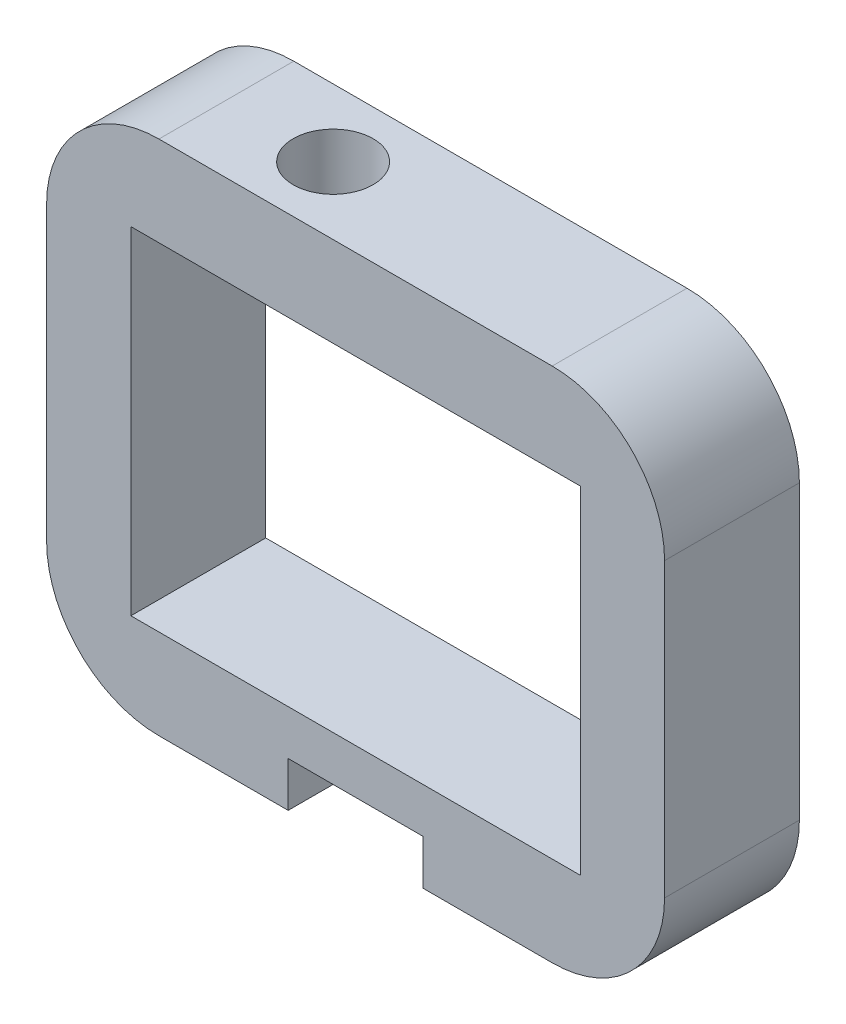
ISO-10303-21;
HEADER;
FILE_DESCRIPTION(('STEP AP214'),'2;1');
FILE_NAME('part.step','',(''),(''),'','','');
FILE_SCHEMA(('AUTOMOTIVE_DESIGN { 1 0 10303 214 1 1 1 1 }'));
ENDSEC;
DATA;
#1=APPLICATION_CONTEXT('core data for automotive mechanical design processes');
#2=APPLICATION_PROTOCOL_DEFINITION('international standard','automotive_design',2000,#1);
#3=PRODUCT_CONTEXT('',#1,'mechanical');
#4=PRODUCT('Part','Part','',(#3));
#5=PRODUCT_RELATED_PRODUCT_CATEGORY('part','',(#4));
#6=PRODUCT_DEFINITION_FORMATION('','',#4);
#7=PRODUCT_DEFINITION_CONTEXT('part definition',#1,'design');
#8=PRODUCT_DEFINITION('design','',#6,#7);
#9=PRODUCT_DEFINITION_SHAPE('','',#8);
#10=(LENGTH_UNIT() NAMED_UNIT(*) SI_UNIT(.MILLI.,.METRE.));
#11=(NAMED_UNIT(*) PLANE_ANGLE_UNIT() SI_UNIT($,.RADIAN.));
#12=(NAMED_UNIT(*) SI_UNIT($,.STERADIAN.) SOLID_ANGLE_UNIT());
#13=UNCERTAINTY_MEASURE_WITH_UNIT(LENGTH_MEASURE(1.E-05),#10,'distance_accuracy_value','');
#14=(GEOMETRIC_REPRESENTATION_CONTEXT(3) GLOBAL_UNCERTAINTY_ASSIGNED_CONTEXT((#13)) GLOBAL_UNIT_ASSIGNED_CONTEXT((#10,
#11,#12)) REPRESENTATION_CONTEXT('',''));
#15=CARTESIAN_POINT('',(0.,0.,0.));
#16=DIRECTION('',(0.,0.,1.));
#17=DIRECTION('',(1.,0.,0.));
#18=AXIS2_PLACEMENT_3D('',#15,#16,#17);
#19=CARTESIAN_POINT('',(-27.5,-23.,6.));
#20=DIRECTION('',(0.,1.,0.));
#21=DIRECTION('',(-1.,0.,0.));
#22=AXIS2_PLACEMENT_3D('',#19,#20,#21);
#23=PLANE('',#22);
#24=DIRECTION('',(1.,0.,0.));
#25=VECTOR('',#24,1.);
#26=CARTESIAN_POINT('',(-27.5,-23.,6.));
#27=LINE('',#26,#25);
#28=CARTESIAN_POINT('',(-17.5,-23.,6.));
#29=VERTEX_POINT('',#28);
#30=CARTESIAN_POINT('',(-6.,-23.,6.));
#31=VERTEX_POINT('',#30);
#32=EDGE_CURVE('E227',#29,#31,#27,.T.);
#33=ORIENTED_EDGE('',*,*,#32,.F.);
#34=DIRECTION('',(0.,0.,-1.));
#35=VECTOR('',#34,1.);
#36=CARTESIAN_POINT('',(-17.5,-23.,6.));
#37=LINE('',#36,#35);
#38=CARTESIAN_POINT('',(-17.5,-23.,-6.));
#39=VERTEX_POINT('',#38);
#40=EDGE_CURVE('E237',#29,#39,#37,.T.);
#41=ORIENTED_EDGE('',*,*,#40,.T.);
#42=DIRECTION('',(1.,0.,0.));
#43=VECTOR('',#42,1.);
#44=CARTESIAN_POINT('',(-27.5,-23.,-6.));
#45=LINE('',#44,#43);
#46=CARTESIAN_POINT('',(-6.,-23.,-6.));
#47=VERTEX_POINT('',#46);
#48=EDGE_CURVE('E238',#39,#47,#45,.T.);
#49=ORIENTED_EDGE('',*,*,#48,.T.);
#50=DIRECTION('',(0.,0.,-1.));
#51=VECTOR('',#50,1.);
#52=CARTESIAN_POINT('',(-6.,-23.,6.));
#53=LINE('',#52,#51);
#54=EDGE_CURVE('E158',#31,#47,#53,.T.);
#55=ORIENTED_EDGE('',*,*,#54,.F.);
#56=EDGE_LOOP('',(#33,#41,#49,#55));
#57=FACE_BOUND('',#56,.T.);
#58=ADVANCED_FACE('F37',(#57),#23,.F.);
#59=CARTESIAN_POINT('',(0.,0.,6.));
#60=DIRECTION('',(0.,0.,-1.));
#61=DIRECTION('',(-1.,0.,0.));
#62=AXIS2_PLACEMENT_3D('',#59,#60,#61);
#63=PLANE('',#62);
#64=DIRECTION('',(0.,-1.,0.));
#65=VECTOR('',#64,1.);
#66=CARTESIAN_POINT('',(-27.5,-23.,6.));
#67=LINE('',#66,#65);
#68=CARTESIAN_POINT('',(-27.5,13.,6.));
#69=VERTEX_POINT('',#68);
#70=CARTESIAN_POINT('',(-27.5,-13.,6.));
#71=VERTEX_POINT('',#70);
#72=EDGE_CURVE('E234',#69,#71,#67,.T.);
#73=ORIENTED_EDGE('',*,*,#72,.T.);
#74=CARTESIAN_POINT('',(-17.5,-13.,6.));
#75=DIRECTION('',(0.,0.,-1.));
#76=DIRECTION('',(-1.,0.,0.));
#77=AXIS2_PLACEMENT_3D('',#74,#75,#76);
#78=CIRCLE('',#77,10.);
#79=EDGE_CURVE('E270',#71,#29,#78,.F.);
#80=ORIENTED_EDGE('',*,*,#79,.T.);
#81=ORIENTED_EDGE('',*,*,#32,.T.);
#82=DIRECTION('',(0.,-1.,0.));
#83=VECTOR('',#82,1.);
#84=CARTESIAN_POINT('',(-6.,-19.,6.));
#85=LINE('',#84,#83);
#86=CARTESIAN_POINT('',(-6.,-19.,6.));
#87=VERTEX_POINT('',#86);
#88=EDGE_CURVE('E185',#87,#31,#85,.T.);
#89=ORIENTED_EDGE('',*,*,#88,.F.);
#90=DIRECTION('',(-1.,0.,0.));
#91=VECTOR('',#90,1.);
#92=CARTESIAN_POINT('',(-6.,-19.,6.));
#93=LINE('',#92,#91);
#94=CARTESIAN_POINT('',(6.,-19.,6.));
#95=VERTEX_POINT('',#94);
#96=EDGE_CURVE('E163',#95,#87,#93,.T.);
#97=ORIENTED_EDGE('',*,*,#96,.F.);
#98=DIRECTION('',(0.,-1.,0.));
#99=VECTOR('',#98,1.);
#100=CARTESIAN_POINT('',(6.,-19.,6.));
#101=LINE('',#100,#99);
#102=CARTESIAN_POINT('',(6.,-23.,6.));
#103=VERTEX_POINT('',#102);
#104=EDGE_CURVE('E188',#95,#103,#101,.T.);
#105=ORIENTED_EDGE('',*,*,#104,.T.);
#106=CARTESIAN_POINT('',(17.5,-23.,6.));
#107=VERTEX_POINT('',#106);
#108=EDGE_CURVE('E230',#103,#107,#27,.T.);
#109=ORIENTED_EDGE('',*,*,#108,.T.);
#110=CARTESIAN_POINT('',(17.5,-13.,6.));
#111=DIRECTION('',(0.,0.,-1.));
#112=DIRECTION('',(-1.,0.,0.));
#113=AXIS2_PLACEMENT_3D('',#110,#111,#112);
#114=CIRCLE('',#113,10.);
#115=CARTESIAN_POINT('',(27.5,-13.,6.));
#116=VERTEX_POINT('',#115);
#117=EDGE_CURVE('E268',#107,#116,#114,.F.);
#118=ORIENTED_EDGE('',*,*,#117,.T.);
#119=DIRECTION('',(0.,1.,0.));
#120=VECTOR('',#119,1.);
#121=CARTESIAN_POINT('',(27.5,23.,6.));
#122=LINE('',#121,#120);
#123=CARTESIAN_POINT('',(27.5,13.,6.));
#124=VERTEX_POINT('',#123);
#125=EDGE_CURVE('E229',#116,#124,#122,.T.);
#126=ORIENTED_EDGE('',*,*,#125,.T.);
#127=CARTESIAN_POINT('',(17.5,13.,6.));
#128=DIRECTION('',(0.,0.,-1.));
#129=DIRECTION('',(-1.,0.,0.));
#130=AXIS2_PLACEMENT_3D('',#127,#128,#129);
#131=CIRCLE('',#130,10.);
#132=CARTESIAN_POINT('',(17.5,23.,6.));
#133=VERTEX_POINT('',#132);
#134=EDGE_CURVE('E58',#124,#133,#131,.F.);
#135=ORIENTED_EDGE('',*,*,#134,.T.);
#136=DIRECTION('',(-1.,0.,0.));
#137=VECTOR('',#136,1.);
#138=CARTESIAN_POINT('',(27.5,23.,6.));
#139=LINE('',#138,#137);
#140=CARTESIAN_POINT('',(-17.5,23.,6.));
#141=VERTEX_POINT('',#140);
#142=EDGE_CURVE('E232',#133,#141,#139,.T.);
#143=ORIENTED_EDGE('',*,*,#142,.T.);
#144=CARTESIAN_POINT('',(-17.5,13.,6.));
#145=DIRECTION('',(0.,0.,-1.));
#146=DIRECTION('',(-1.,0.,0.));
#147=AXIS2_PLACEMENT_3D('',#144,#145,#146);
#148=CIRCLE('',#147,10.);
#149=EDGE_CURVE('E265',#141,#69,#148,.F.);
#150=ORIENTED_EDGE('',*,*,#149,.T.);
#151=EDGE_LOOP('',(#73,#80,#81,#89,#97,#105,#109,#118,#126,#135,#143,#150));
#152=FACE_BOUND('',#151,.T.);
#153=DIRECTION('',(0.,1.,0.));
#154=VECTOR('',#153,1.);
#155=CARTESIAN_POINT('',(20.,-15.,6.));
#156=LINE('',#155,#154);
#157=CARTESIAN_POINT('',(20.,-15.,6.));
#158=VERTEX_POINT('',#157);
#159=CARTESIAN_POINT('',(20.,15.,6.));
#160=VERTEX_POINT('',#159);
#161=EDGE_CURVE('E195',#158,#160,#156,.T.);
#162=ORIENTED_EDGE('',*,*,#161,.F.);
#163=DIRECTION('',(1.,0.,0.));
#164=VECTOR('',#163,1.);
#165=CARTESIAN_POINT('',(-20.,-15.,6.));
#166=LINE('',#165,#164);
#167=CARTESIAN_POINT('',(-20.,-15.,6.));
#168=VERTEX_POINT('',#167);
#169=EDGE_CURVE('E203',#168,#158,#166,.T.);
#170=ORIENTED_EDGE('',*,*,#169,.F.);
#171=DIRECTION('',(0.,-1.,0.));
#172=VECTOR('',#171,1.);
#173=CARTESIAN_POINT('',(-20.,15.,6.));
#174=LINE('',#173,#172);
#175=CARTESIAN_POINT('',(-20.,15.,6.));
#176=VERTEX_POINT('',#175);
#177=EDGE_CURVE('E200',#176,#168,#174,.T.);
#178=ORIENTED_EDGE('',*,*,#177,.F.);
#179=DIRECTION('',(-1.,0.,0.));
#180=VECTOR('',#179,1.);
#181=CARTESIAN_POINT('',(20.,15.,6.));
#182=LINE('',#181,#180);
#183=EDGE_CURVE('E197',#160,#176,#182,.T.);
#184=ORIENTED_EDGE('',*,*,#183,.F.);
#185=EDGE_LOOP('',(#162,#170,#178,#184));
#186=FACE_BOUND('',#185,.T.);
#187=ADVANCED_FACE('F287',(#152,#186),#63,.F.);
#188=CARTESIAN_POINT('',(0.,0.,-6.));
#189=DIRECTION('',(0.,0.,-1.));
#190=DIRECTION('',(-1.,0.,0.));
#191=AXIS2_PLACEMENT_3D('',#188,#189,#190);
#192=PLANE('',#191);
#193=ORIENTED_EDGE('',*,*,#48,.F.);
#194=CARTESIAN_POINT('',(-17.5,-13.,-6.));
#195=DIRECTION('',(0.,0.,-1.));
#196=DIRECTION('',(-1.,0.,0.));
#197=AXIS2_PLACEMENT_3D('',#194,#195,#196);
#198=CIRCLE('',#197,10.);
#199=CARTESIAN_POINT('',(-27.5,-13.,-6.));
#200=VERTEX_POINT('',#199);
#201=EDGE_CURVE('E258',#39,#200,#198,.T.);
#202=ORIENTED_EDGE('',*,*,#201,.T.);
#203=DIRECTION('',(0.,-1.,0.));
#204=VECTOR('',#203,1.);
#205=CARTESIAN_POINT('',(-27.5,-23.,-6.));
#206=LINE('',#205,#204);
#207=CARTESIAN_POINT('',(-27.5,13.,-6.));
#208=VERTEX_POINT('',#207);
#209=EDGE_CURVE('E245',#208,#200,#206,.T.);
#210=ORIENTED_EDGE('',*,*,#209,.F.);
#211=CARTESIAN_POINT('',(-17.5,13.,-6.));
#212=DIRECTION('',(0.,0.,-1.));
#213=DIRECTION('',(-1.,0.,0.));
#214=AXIS2_PLACEMENT_3D('',#211,#212,#213);
#215=CIRCLE('',#214,10.);
#216=CARTESIAN_POINT('',(-17.5,23.,-6.));
#217=VERTEX_POINT('',#216);
#218=EDGE_CURVE('E252',#208,#217,#215,.T.);
#219=ORIENTED_EDGE('',*,*,#218,.T.);
#220=DIRECTION('',(-1.,0.,0.));
#221=VECTOR('',#220,1.);
#222=CARTESIAN_POINT('',(27.5,23.,-6.));
#223=LINE('',#222,#221);
#224=CARTESIAN_POINT('',(17.5,23.,-6.));
#225=VERTEX_POINT('',#224);
#226=EDGE_CURVE('E243',#225,#217,#223,.T.);
#227=ORIENTED_EDGE('',*,*,#226,.F.);
#228=CARTESIAN_POINT('',(17.5,13.,-6.));
#229=DIRECTION('',(0.,0.,-1.));
#230=DIRECTION('',(-1.,0.,0.));
#231=AXIS2_PLACEMENT_3D('',#228,#229,#230);
#232=CIRCLE('',#231,10.);
#233=CARTESIAN_POINT('',(27.5,13.,-6.));
#234=VERTEX_POINT('',#233);
#235=EDGE_CURVE('E254',#225,#234,#232,.T.);
#236=ORIENTED_EDGE('',*,*,#235,.T.);
#237=DIRECTION('',(0.,1.,0.));
#238=VECTOR('',#237,1.);
#239=CARTESIAN_POINT('',(27.5,23.,-6.));
#240=LINE('',#239,#238);
#241=CARTESIAN_POINT('',(27.5,-13.,-6.));
#242=VERTEX_POINT('',#241);
#243=EDGE_CURVE('E240',#242,#234,#240,.T.);
#244=ORIENTED_EDGE('',*,*,#243,.F.);
#245=CARTESIAN_POINT('',(17.5,-13.,-6.));
#246=DIRECTION('',(0.,0.,-1.));
#247=DIRECTION('',(-1.,0.,0.));
#248=AXIS2_PLACEMENT_3D('',#245,#246,#247);
#249=CIRCLE('',#248,10.);
#250=CARTESIAN_POINT('',(17.5,-23.,-6.));
#251=VERTEX_POINT('',#250);
#252=EDGE_CURVE('E256',#242,#251,#249,.T.);
#253=ORIENTED_EDGE('',*,*,#252,.T.);
#254=CARTESIAN_POINT('',(6.,-23.,-6.));
#255=VERTEX_POINT('',#254);
#256=EDGE_CURVE('E226',#255,#251,#45,.T.);
#257=ORIENTED_EDGE('',*,*,#256,.F.);
#258=DIRECTION('',(0.,-1.,0.));
#259=VECTOR('',#258,1.);
#260=CARTESIAN_POINT('',(6.,-19.,-6.));
#261=LINE('',#260,#259);
#262=CARTESIAN_POINT('',(6.,-19.,-6.));
#263=VERTEX_POINT('',#262);
#264=EDGE_CURVE('E162',#263,#255,#261,.T.);
#265=ORIENTED_EDGE('',*,*,#264,.F.);
#266=DIRECTION('',(1.,0.,0.));
#267=VECTOR('',#266,1.);
#268=CARTESIAN_POINT('',(-6.,-19.,-6.));
#269=LINE('',#268,#267);
#270=CARTESIAN_POINT('',(-6.,-19.,-6.));
#271=VERTEX_POINT('',#270);
#272=EDGE_CURVE('E169',#271,#263,#269,.T.);
#273=ORIENTED_EDGE('',*,*,#272,.F.);
#274=DIRECTION('',(0.,-1.,0.));
#275=VECTOR('',#274,1.);
#276=CARTESIAN_POINT('',(-6.,-19.,-6.));
#277=LINE('',#276,#275);
#278=EDGE_CURVE('E151',#271,#47,#277,.T.);
#279=ORIENTED_EDGE('',*,*,#278,.T.);
#280=EDGE_LOOP('',(#193,#202,#210,#219,#227,#236,#244,#253,#257,#265,#273,#279));
#281=FACE_BOUND('',#280,.T.);
#282=DIRECTION('',(1.,0.,0.));
#283=VECTOR('',#282,1.);
#284=CARTESIAN_POINT('',(-20.,-15.,-6.));
#285=LINE('',#284,#283);
#286=CARTESIAN_POINT('',(-20.,-15.,-6.));
#287=VERTEX_POINT('',#286);
#288=CARTESIAN_POINT('',(20.,-15.,-6.));
#289=VERTEX_POINT('',#288);
#290=EDGE_CURVE('E198',#287,#289,#285,.T.);
#291=ORIENTED_EDGE('',*,*,#290,.T.);
#292=DIRECTION('',(0.,1.,0.));
#293=VECTOR('',#292,1.);
#294=CARTESIAN_POINT('',(20.,-15.,-6.));
#295=LINE('',#294,#293);
#296=CARTESIAN_POINT('',(20.,15.,-6.));
#297=VERTEX_POINT('',#296);
#298=EDGE_CURVE('E206',#289,#297,#295,.T.);
#299=ORIENTED_EDGE('',*,*,#298,.T.);
#300=DIRECTION('',(-1.,0.,0.));
#301=VECTOR('',#300,1.);
#302=CARTESIAN_POINT('',(20.,15.,-6.));
#303=LINE('',#302,#301);
#304=CARTESIAN_POINT('',(-20.,15.,-6.));
#305=VERTEX_POINT('',#304);
#306=EDGE_CURVE('E209',#297,#305,#303,.T.);
#307=ORIENTED_EDGE('',*,*,#306,.T.);
#308=DIRECTION('',(0.,-1.,0.));
#309=VECTOR('',#308,1.);
#310=CARTESIAN_POINT('',(-20.,15.,-6.));
#311=LINE('',#310,#309);
#312=EDGE_CURVE('E212',#305,#287,#311,.T.);
#313=ORIENTED_EDGE('',*,*,#312,.T.);
#314=EDGE_LOOP('',(#291,#299,#307,#313));
#315=FACE_BOUND('',#314,.T.);
#316=ADVANCED_FACE('F175',(#281,#315),#192,.T.);
#317=ORIENTED_EDGE('',*,*,#256,.T.);
#318=DIRECTION('',(0.,0.,-1.));
#319=VECTOR('',#318,1.);
#320=CARTESIAN_POINT('',(17.5,-23.,6.));
#321=LINE('',#320,#319);
#322=EDGE_CURVE('E277',#251,#107,#321,.F.);
#323=ORIENTED_EDGE('',*,*,#322,.T.);
#324=ORIENTED_EDGE('',*,*,#108,.F.);
#325=DIRECTION('',(0.,0.,1.));
#326=VECTOR('',#325,1.);
#327=CARTESIAN_POINT('',(6.,-23.,6.));
#328=LINE('',#327,#326);
#329=EDGE_CURVE('E173',#255,#103,#328,.T.);
#330=ORIENTED_EDGE('',*,*,#329,.F.);
#331=EDGE_LOOP('',(#317,#323,#324,#330));
#332=FACE_BOUND('',#331,.T.);
#333=ADVANCED_FACE('F283',(#332),#23,.F.);
#334=CARTESIAN_POINT('',(27.5,23.,6.));
#335=DIRECTION('',(-1.,0.,0.));
#336=DIRECTION('',(0.,-1.,0.));
#337=AXIS2_PLACEMENT_3D('',#334,#335,#336);
#338=PLANE('',#337);
#339=ORIENTED_EDGE('',*,*,#125,.F.);
#340=DIRECTION('',(0.,0.,-1.));
#341=VECTOR('',#340,1.);
#342=CARTESIAN_POINT('',(27.5,-13.,6.));
#343=LINE('',#342,#341);
#344=EDGE_CURVE('E274',#116,#242,#343,.T.);
#345=ORIENTED_EDGE('',*,*,#344,.T.);
#346=ORIENTED_EDGE('',*,*,#243,.T.);
#347=DIRECTION('',(0.,0.,-1.));
#348=VECTOR('',#347,1.);
#349=CARTESIAN_POINT('',(27.5,13.,6.));
#350=LINE('',#349,#348);
#351=EDGE_CURVE('E272',#234,#124,#350,.F.);
#352=ORIENTED_EDGE('',*,*,#351,.T.);
#353=EDGE_LOOP('',(#339,#345,#346,#352));
#354=FACE_BOUND('',#353,.T.);
#355=ADVANCED_FACE('F294',(#354),#338,.F.);
#356=CARTESIAN_POINT('',(27.5,23.,6.));
#357=DIRECTION('',(0.,-1.,0.));
#358=DIRECTION('',(1.,0.,0.));
#359=AXIS2_PLACEMENT_3D('',#356,#357,#358);
#360=PLANE('',#359);
#361=CARTESIAN_POINT('',(-8.,23.,0.));
#362=DIRECTION('',(0.,1.,0.));
#363=DIRECTION('',(0.,0.,1.));
#364=AXIS2_PLACEMENT_3D('',#361,#362,#363);
#365=CIRCLE('',#364,3.556);
#366=CARTESIAN_POINT('',(-8.,23.,3.556));
#367=VERTEX_POINT('',#366);
#368=EDGE_CURVE('E187',#367,#367,#365,.T.);
#369=ORIENTED_EDGE('',*,*,#368,.F.);
#370=EDGE_LOOP('',(#369));
#371=FACE_BOUND('',#370,.T.);
#372=ORIENTED_EDGE('',*,*,#142,.F.);
#373=DIRECTION('',(0.,0.,-1.));
#374=VECTOR('',#373,1.);
#375=CARTESIAN_POINT('',(17.5,23.,6.));
#376=LINE('',#375,#374);
#377=EDGE_CURVE('E11',#133,#225,#376,.T.);
#378=ORIENTED_EDGE('',*,*,#377,.T.);
#379=ORIENTED_EDGE('',*,*,#226,.T.);
#380=DIRECTION('',(0.,0.,-1.));
#381=VECTOR('',#380,1.);
#382=CARTESIAN_POINT('',(-17.5,23.,6.));
#383=LINE('',#382,#381);
#384=EDGE_CURVE('E45',#217,#141,#383,.F.);
#385=ORIENTED_EDGE('',*,*,#384,.T.);
#386=EDGE_LOOP('',(#372,#378,#379,#385));
#387=FACE_BOUND('',#386,.T.);
#388=ADVANCED_FACE('F300',(#371,#387),#360,.F.);
#389=CARTESIAN_POINT('',(-27.5,-23.,6.));
#390=DIRECTION('',(1.,0.,0.));
#391=DIRECTION('',(0.,0.,-1.));
#392=AXIS2_PLACEMENT_3D('',#389,#390,#391);
#393=PLANE('',#392);
#394=ORIENTED_EDGE('',*,*,#209,.T.);
#395=DIRECTION('',(0.,0.,-1.));
#396=VECTOR('',#395,1.);
#397=CARTESIAN_POINT('',(-27.5,-13.,6.));
#398=LINE('',#397,#396);
#399=EDGE_CURVE('E263',#200,#71,#398,.F.);
#400=ORIENTED_EDGE('',*,*,#399,.T.);
#401=ORIENTED_EDGE('',*,*,#72,.F.);
#402=DIRECTION('',(0.,0.,-1.));
#403=VECTOR('',#402,1.);
#404=CARTESIAN_POINT('',(-27.5,13.,6.));
#405=LINE('',#404,#403);
#406=EDGE_CURVE('E260',#69,#208,#405,.T.);
#407=ORIENTED_EDGE('',*,*,#406,.T.);
#408=EDGE_LOOP('',(#394,#400,#401,#407));
#409=FACE_BOUND('',#408,.T.);
#410=ADVANCED_FACE('F307',(#409),#393,.F.);
#411=CARTESIAN_POINT('',(20.,-15.,6.));
#412=DIRECTION('',(-1.,0.,0.));
#413=DIRECTION('',(0.,-1.,0.));
#414=AXIS2_PLACEMENT_3D('',#411,#412,#413);
#415=PLANE('',#414);
#416=ORIENTED_EDGE('',*,*,#298,.F.);
#417=DIRECTION('',(0.,0.,-1.));
#418=VECTOR('',#417,1.);
#419=CARTESIAN_POINT('',(20.,-15.,6.));
#420=LINE('',#419,#418);
#421=EDGE_CURVE('E205',#158,#289,#420,.T.);
#422=ORIENTED_EDGE('',*,*,#421,.F.);
#423=ORIENTED_EDGE('',*,*,#161,.T.);
#424=DIRECTION('',(0.,0.,-1.));
#425=VECTOR('',#424,1.);
#426=CARTESIAN_POINT('',(20.,15.,6.));
#427=LINE('',#426,#425);
#428=EDGE_CURVE('E223',#160,#297,#427,.T.);
#429=ORIENTED_EDGE('',*,*,#428,.T.);
#430=EDGE_LOOP('',(#416,#422,#423,#429));
#431=FACE_BOUND('',#430,.T.);
#432=ADVANCED_FACE('F335',(#431),#415,.T.);
#433=CARTESIAN_POINT('',(20.,15.,6.));
#434=DIRECTION('',(0.,-1.,0.));
#435=DIRECTION('',(1.,0.,0.));
#436=AXIS2_PLACEMENT_3D('',#433,#434,#435);
#437=PLANE('',#436);
#438=CARTESIAN_POINT('',(-8.,15.,0.));
#439=DIRECTION('',(0.,-1.,0.));
#440=DIRECTION('',(1.,0.,0.));
#441=AXIS2_PLACEMENT_3D('',#438,#439,#440);
#442=CIRCLE('',#441,3.556);
#443=CARTESIAN_POINT('',(-4.444,15.,0.));
#444=VERTEX_POINT('',#443);
#445=EDGE_CURVE('E194',#444,#444,#442,.F.);
#446=ORIENTED_EDGE('',*,*,#445,.T.);
#447=EDGE_LOOP('',(#446));
#448=FACE_BOUND('',#447,.T.);
#449=ORIENTED_EDGE('',*,*,#306,.F.);
#450=ORIENTED_EDGE('',*,*,#428,.F.);
#451=ORIENTED_EDGE('',*,*,#183,.T.);
#452=DIRECTION('',(0.,0.,-1.));
#453=VECTOR('',#452,1.);
#454=CARTESIAN_POINT('',(-20.,15.,6.));
#455=LINE('',#454,#453);
#456=EDGE_CURVE('E221',#176,#305,#455,.T.);
#457=ORIENTED_EDGE('',*,*,#456,.T.);
#458=EDGE_LOOP('',(#449,#450,#451,#457));
#459=FACE_BOUND('',#458,.T.);
#460=ADVANCED_FACE('F361',(#448,#459),#437,.T.);
#461=CARTESIAN_POINT('',(-20.,15.,6.));
#462=DIRECTION('',(1.,0.,0.));
#463=DIRECTION('',(0.,1.,0.));
#464=AXIS2_PLACEMENT_3D('',#461,#462,#463);
#465=PLANE('',#464);
#466=ORIENTED_EDGE('',*,*,#312,.F.);
#467=ORIENTED_EDGE('',*,*,#456,.F.);
#468=ORIENTED_EDGE('',*,*,#177,.T.);
#469=DIRECTION('',(0.,0.,-1.));
#470=VECTOR('',#469,1.);
#471=CARTESIAN_POINT('',(-20.,-15.,6.));
#472=LINE('',#471,#470);
#473=EDGE_CURVE('E219',#168,#287,#472,.T.);
#474=ORIENTED_EDGE('',*,*,#473,.T.);
#475=EDGE_LOOP('',(#466,#467,#468,#474));
#476=FACE_BOUND('',#475,.T.);
#477=ADVANCED_FACE('F353',(#476),#465,.T.);
#478=CARTESIAN_POINT('',(-20.,-15.,6.));
#479=DIRECTION('',(0.,1.,0.));
#480=DIRECTION('',(0.,0.,1.));
#481=AXIS2_PLACEMENT_3D('',#478,#479,#480);
#482=PLANE('',#481);
#483=ORIENTED_EDGE('',*,*,#290,.F.);
#484=ORIENTED_EDGE('',*,*,#473,.F.);
#485=ORIENTED_EDGE('',*,*,#169,.T.);
#486=ORIENTED_EDGE('',*,*,#421,.T.);
#487=EDGE_LOOP('',(#483,#484,#485,#486));
#488=FACE_BOUND('',#487,.T.);
#489=ADVANCED_FACE('F344',(#488),#482,.T.);
#490=CARTESIAN_POINT('',(-8.,23.,0.));
#491=DIRECTION('',(0.,-1.,0.));
#492=DIRECTION('',(0.,0.,-1.));
#493=AXIS2_PLACEMENT_3D('',#490,#491,#492);
#494=CYLINDRICAL_SURFACE('',#493,3.556);
#495=ORIENTED_EDGE('',*,*,#445,.F.);
#496=EDGE_LOOP('',(#495));
#497=FACE_BOUND('',#496,.T.);
#498=ORIENTED_EDGE('',*,*,#368,.T.);
#499=EDGE_LOOP('',(#498));
#500=FACE_BOUND('',#499,.T.);
#501=ADVANCED_FACE('F342',(#497,#500),#494,.F.);
#502=CARTESIAN_POINT('',(-6.,-19.,6.));
#503=DIRECTION('',(-1.,0.,0.));
#504=DIRECTION('',(0.,0.,1.));
#505=AXIS2_PLACEMENT_3D('',#502,#503,#504);
#506=PLANE('',#505);
#507=ORIENTED_EDGE('',*,*,#54,.T.);
#508=ORIENTED_EDGE('',*,*,#278,.F.);
#509=DIRECTION('',(0.,0.,-1.));
#510=VECTOR('',#509,1.);
#511=CARTESIAN_POINT('',(-6.,-19.,6.));
#512=LINE('',#511,#510);
#513=EDGE_CURVE('E155',#87,#271,#512,.T.);
#514=ORIENTED_EDGE('',*,*,#513,.F.);
#515=ORIENTED_EDGE('',*,*,#88,.T.);
#516=EDGE_LOOP('',(#507,#508,#514,#515));
#517=FACE_BOUND('',#516,.T.);
#518=ADVANCED_FACE('F153',(#517),#506,.F.);
#519=CARTESIAN_POINT('',(6.,-19.,6.));
#520=DIRECTION('',(1.,0.,0.));
#521=DIRECTION('',(0.,1.,0.));
#522=AXIS2_PLACEMENT_3D('',#519,#520,#521);
#523=PLANE('',#522);
#524=ORIENTED_EDGE('',*,*,#329,.T.);
#525=ORIENTED_EDGE('',*,*,#104,.F.);
#526=DIRECTION('',(0.,0.,1.));
#527=VECTOR('',#526,1.);
#528=CARTESIAN_POINT('',(6.,-19.,6.));
#529=LINE('',#528,#527);
#530=EDGE_CURVE('E178',#263,#95,#529,.T.);
#531=ORIENTED_EDGE('',*,*,#530,.F.);
#532=ORIENTED_EDGE('',*,*,#264,.T.);
#533=EDGE_LOOP('',(#524,#525,#531,#532));
#534=FACE_BOUND('',#533,.T.);
#535=ADVANCED_FACE('F351',(#534),#523,.F.);
#536=CARTESIAN_POINT('',(0.,-19.,0.));
#537=DIRECTION('',(0.,-1.,0.));
#538=DIRECTION('',(0.,0.,-1.));
#539=AXIS2_PLACEMENT_3D('',#536,#537,#538);
#540=PLANE('',#539);
#541=ORIENTED_EDGE('',*,*,#513,.T.);
#542=ORIENTED_EDGE('',*,*,#272,.T.);
#543=ORIENTED_EDGE('',*,*,#530,.T.);
#544=ORIENTED_EDGE('',*,*,#96,.T.);
#545=EDGE_LOOP('',(#541,#542,#543,#544));
#546=FACE_BOUND('',#545,.T.);
#547=ADVANCED_FACE('F167',(#546),#540,.T.);
#548=CARTESIAN_POINT('',(-17.5,-13.,6.));
#549=DIRECTION('',(0.,0.,-1.));
#550=DIRECTION('',(-1.,0.,0.));
#551=AXIS2_PLACEMENT_3D('',#548,#549,#550);
#552=CYLINDRICAL_SURFACE('',#551,10.);
#553=ORIENTED_EDGE('',*,*,#79,.F.);
#554=ORIENTED_EDGE('',*,*,#399,.F.);
#555=ORIENTED_EDGE('',*,*,#201,.F.);
#556=ORIENTED_EDGE('',*,*,#40,.F.);
#557=EDGE_LOOP('',(#553,#554,#555,#556));
#558=FACE_BOUND('',#557,.T.);
#559=ADVANCED_FACE('F312',(#558),#552,.T.);
#560=CARTESIAN_POINT('',(17.5,-13.,6.));
#561=DIRECTION('',(0.,0.,-1.));
#562=DIRECTION('',(-1.,0.,0.));
#563=AXIS2_PLACEMENT_3D('',#560,#561,#562);
#564=CYLINDRICAL_SURFACE('',#563,10.);
#565=ORIENTED_EDGE('',*,*,#117,.F.);
#566=ORIENTED_EDGE('',*,*,#322,.F.);
#567=ORIENTED_EDGE('',*,*,#252,.F.);
#568=ORIENTED_EDGE('',*,*,#344,.F.);
#569=EDGE_LOOP('',(#565,#566,#567,#568));
#570=FACE_BOUND('',#569,.T.);
#571=ADVANCED_FACE('F291',(#570),#564,.T.);
#572=CARTESIAN_POINT('',(17.5,13.,6.));
#573=DIRECTION('',(0.,0.,-1.));
#574=DIRECTION('',(-1.,0.,0.));
#575=AXIS2_PLACEMENT_3D('',#572,#573,#574);
#576=CYLINDRICAL_SURFACE('',#575,10.);
#577=ORIENTED_EDGE('',*,*,#134,.F.);
#578=ORIENTED_EDGE('',*,*,#351,.F.);
#579=ORIENTED_EDGE('',*,*,#235,.F.);
#580=ORIENTED_EDGE('',*,*,#377,.F.);
#581=EDGE_LOOP('',(#577,#578,#579,#580));
#582=FACE_BOUND('',#581,.T.);
#583=ADVANCED_FACE('F299',(#582),#576,.T.);
#584=CARTESIAN_POINT('',(-17.5,13.,6.));
#585=DIRECTION('',(0.,0.,-1.));
#586=DIRECTION('',(-1.,0.,0.));
#587=AXIS2_PLACEMENT_3D('',#584,#585,#586);
#588=CYLINDRICAL_SURFACE('',#587,10.);
#589=ORIENTED_EDGE('',*,*,#149,.F.);
#590=ORIENTED_EDGE('',*,*,#384,.F.);
#591=ORIENTED_EDGE('',*,*,#218,.F.);
#592=ORIENTED_EDGE('',*,*,#406,.F.);
#593=EDGE_LOOP('',(#589,#590,#591,#592));
#594=FACE_BOUND('',#593,.T.);
#595=ADVANCED_FACE('F39',(#594),#588,.T.);
#596=CLOSED_SHELL('',(#58,#187,#316,#333,#355,#388,#410,#432,#460,#477,#489,#501,#518,#535,#547,
#559,#571,#583,#595));
#597=MANIFOLD_SOLID_BREP('B2',#596);
#598=ADVANCED_BREP_SHAPE_REPRESENTATION('',(#18,#597),#14);
#599=SHAPE_DEFINITION_REPRESENTATION(#9,#598);
ENDSEC;
END-ISO-10303-21;
